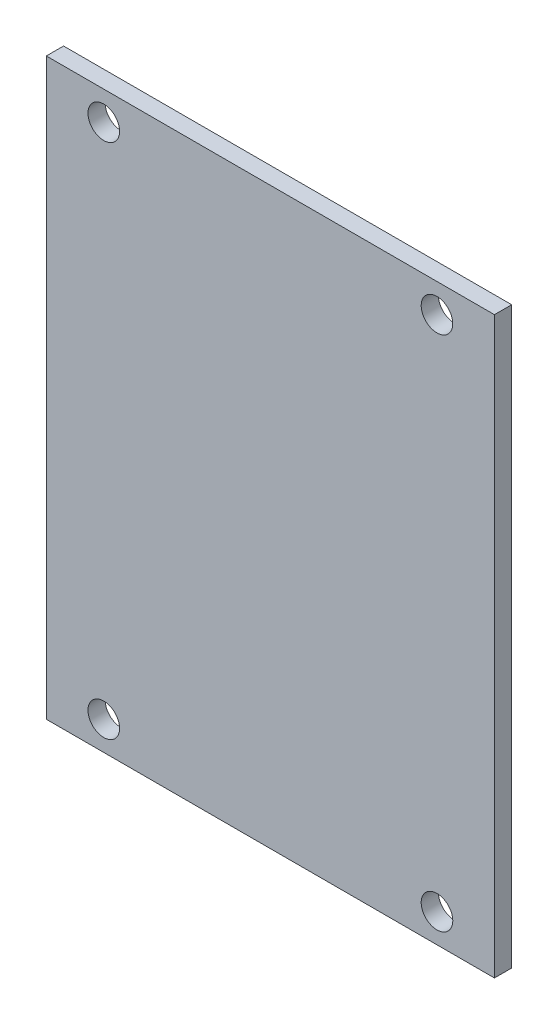
ISO-10303-21;
HEADER;
FILE_DESCRIPTION(('STEP AP214'),'2;1');
FILE_NAME('part.step','',(''),(''),'','','');
FILE_SCHEMA(('AUTOMOTIVE_DESIGN { 1 0 10303 214 1 1 1 1 }'));
ENDSEC;
DATA;
#1=APPLICATION_CONTEXT('core data for automotive mechanical design processes');
#2=APPLICATION_PROTOCOL_DEFINITION('international standard','automotive_design',2000,#1);
#3=PRODUCT_CONTEXT('',#1,'mechanical');
#4=PRODUCT('Part','Part','',(#3));
#5=PRODUCT_RELATED_PRODUCT_CATEGORY('part','',(#4));
#6=PRODUCT_DEFINITION_FORMATION('','',#4);
#7=PRODUCT_DEFINITION_CONTEXT('part definition',#1,'design');
#8=PRODUCT_DEFINITION('design','',#6,#7);
#9=PRODUCT_DEFINITION_SHAPE('','',#8);
#10=(LENGTH_UNIT() NAMED_UNIT(*) SI_UNIT(.MILLI.,.METRE.));
#11=(NAMED_UNIT(*) PLANE_ANGLE_UNIT() SI_UNIT($,.RADIAN.));
#12=(NAMED_UNIT(*) SI_UNIT($,.STERADIAN.) SOLID_ANGLE_UNIT());
#13=UNCERTAINTY_MEASURE_WITH_UNIT(LENGTH_MEASURE(1.E-05),#10,'distance_accuracy_value','');
#14=(GEOMETRIC_REPRESENTATION_CONTEXT(3) GLOBAL_UNCERTAINTY_ASSIGNED_CONTEXT((#13)) GLOBAL_UNIT_ASSIGNED_CONTEXT((#10,
#11,#12)) REPRESENTATION_CONTEXT('',''));
#15=CARTESIAN_POINT('',(0.,0.,0.));
#16=DIRECTION('',(0.,0.,1.));
#17=DIRECTION('',(1.,0.,0.));
#18=AXIS2_PLACEMENT_3D('',#15,#16,#17);
#19=CARTESIAN_POINT('',(0.,0.,3.));
#20=DIRECTION('',(1.,0.,0.));
#21=DIRECTION('',(0.,1.,0.));
#22=AXIS2_PLACEMENT_3D('',#19,#20,#21);
#23=PLANE('',#22);
#24=DIRECTION('',(0.,-1.,0.));
#25=VECTOR('',#24,1.);
#26=CARTESIAN_POINT('',(0.,0.,0.));
#27=LINE('',#26,#25);
#28=CARTESIAN_POINT('',(0.,100.,0.));
#29=VERTEX_POINT('',#28);
#30=CARTESIAN_POINT('',(0.,0.,0.));
#31=VERTEX_POINT('',#30);
#32=EDGE_CURVE('E101',#29,#31,#27,.T.);
#33=ORIENTED_EDGE('',*,*,#32,.T.);
#34=DIRECTION('',(0.,0.,-1.));
#35=VECTOR('',#34,1.);
#36=CARTESIAN_POINT('',(0.,0.,3.));
#37=LINE('',#36,#35);
#38=CARTESIAN_POINT('',(0.,0.,3.));
#39=VERTEX_POINT('',#38);
#40=EDGE_CURVE('E11',#39,#31,#37,.T.);
#41=ORIENTED_EDGE('',*,*,#40,.F.);
#42=DIRECTION('',(0.,-1.,0.));
#43=VECTOR('',#42,1.);
#44=CARTESIAN_POINT('',(0.,0.,3.));
#45=LINE('',#44,#43);
#46=CARTESIAN_POINT('',(0.,100.,3.));
#47=VERTEX_POINT('',#46);
#48=EDGE_CURVE('E88',#47,#39,#45,.T.);
#49=ORIENTED_EDGE('',*,*,#48,.F.);
#50=DIRECTION('',(0.,0.,-1.));
#51=VECTOR('',#50,1.);
#52=CARTESIAN_POINT('',(0.,100.,3.));
#53=LINE('',#52,#51);
#54=EDGE_CURVE('E97',#47,#29,#53,.T.);
#55=ORIENTED_EDGE('',*,*,#54,.T.);
#56=EDGE_LOOP('',(#33,#41,#49,#55));
#57=FACE_BOUND('',#56,.T.);
#58=ADVANCED_FACE('F35',(#57),#23,.F.);
#59=CARTESIAN_POINT('',(0.,0.,3.));
#60=DIRECTION('',(0.,1.,0.));
#61=DIRECTION('',(0.,0.,1.));
#62=AXIS2_PLACEMENT_3D('',#59,#60,#61);
#63=PLANE('',#62);
#64=DIRECTION('',(1.,0.,0.));
#65=VECTOR('',#64,1.);
#66=CARTESIAN_POINT('',(0.,0.,0.));
#67=LINE('',#66,#65);
#68=CARTESIAN_POINT('',(78.,0.,0.));
#69=VERTEX_POINT('',#68);
#70=EDGE_CURVE('E92',#31,#69,#67,.T.);
#71=ORIENTED_EDGE('',*,*,#70,.T.);
#72=DIRECTION('',(0.,0.,-1.));
#73=VECTOR('',#72,1.);
#74=CARTESIAN_POINT('',(78.,0.,3.));
#75=LINE('',#74,#73);
#76=CARTESIAN_POINT('',(78.,0.,3.));
#77=VERTEX_POINT('',#76);
#78=EDGE_CURVE('E44',#77,#69,#75,.T.);
#79=ORIENTED_EDGE('',*,*,#78,.F.);
#80=DIRECTION('',(1.,0.,0.));
#81=VECTOR('',#80,1.);
#82=CARTESIAN_POINT('',(0.,0.,3.));
#83=LINE('',#82,#81);
#84=EDGE_CURVE('E83',#39,#77,#83,.T.);
#85=ORIENTED_EDGE('',*,*,#84,.F.);
#86=ORIENTED_EDGE('',*,*,#40,.T.);
#87=EDGE_LOOP('',(#71,#79,#85,#86));
#88=FACE_BOUND('',#87,.T.);
#89=ADVANCED_FACE('F91',(#88),#63,.F.);
#90=CARTESIAN_POINT('',(78.,0.,3.));
#91=DIRECTION('',(-1.,0.,0.));
#92=DIRECTION('',(0.,-1.,0.));
#93=AXIS2_PLACEMENT_3D('',#90,#91,#92);
#94=PLANE('',#93);
#95=DIRECTION('',(0.,1.,0.));
#96=VECTOR('',#95,1.);
#97=CARTESIAN_POINT('',(78.,0.,0.));
#98=LINE('',#97,#96);
#99=CARTESIAN_POINT('',(78.,100.,0.));
#100=VERTEX_POINT('',#99);
#101=EDGE_CURVE('E70',#69,#100,#98,.T.);
#102=ORIENTED_EDGE('',*,*,#101,.T.);
#103=DIRECTION('',(0.,0.,-1.));
#104=VECTOR('',#103,1.);
#105=CARTESIAN_POINT('',(78.,100.,3.));
#106=LINE('',#105,#104);
#107=CARTESIAN_POINT('',(78.,100.,3.));
#108=VERTEX_POINT('',#107);
#109=EDGE_CURVE('E93',#108,#100,#106,.T.);
#110=ORIENTED_EDGE('',*,*,#109,.F.);
#111=DIRECTION('',(0.,1.,0.));
#112=VECTOR('',#111,1.);
#113=CARTESIAN_POINT('',(78.,0.,3.));
#114=LINE('',#113,#112);
#115=EDGE_CURVE('E86',#77,#108,#114,.T.);
#116=ORIENTED_EDGE('',*,*,#115,.F.);
#117=ORIENTED_EDGE('',*,*,#78,.T.);
#118=EDGE_LOOP('',(#102,#110,#116,#117));
#119=FACE_BOUND('',#118,.T.);
#120=ADVANCED_FACE('F95',(#119),#94,.F.);
#121=CARTESIAN_POINT('',(0.,100.,3.));
#122=DIRECTION('',(0.,-1.,0.));
#123=DIRECTION('',(0.,0.,-1.));
#124=AXIS2_PLACEMENT_3D('',#121,#122,#123);
#125=PLANE('',#124);
#126=DIRECTION('',(-1.,0.,0.));
#127=VECTOR('',#126,1.);
#128=CARTESIAN_POINT('',(0.,100.,0.));
#129=LINE('',#128,#127);
#130=EDGE_CURVE('E76',#100,#29,#129,.T.);
#131=ORIENTED_EDGE('',*,*,#130,.T.);
#132=ORIENTED_EDGE('',*,*,#54,.F.);
#133=DIRECTION('',(-1.,0.,0.));
#134=VECTOR('',#133,1.);
#135=CARTESIAN_POINT('',(0.,100.,3.));
#136=LINE('',#135,#134);
#137=EDGE_CURVE('E53',#108,#47,#136,.T.);
#138=ORIENTED_EDGE('',*,*,#137,.F.);
#139=ORIENTED_EDGE('',*,*,#109,.T.);
#140=EDGE_LOOP('',(#131,#132,#138,#139));
#141=FACE_BOUND('',#140,.T.);
#142=ADVANCED_FACE('F142',(#141),#125,.F.);
#143=CARTESIAN_POINT('',(0.,0.,3.));
#144=DIRECTION('',(0.,0.,-1.));
#145=DIRECTION('',(-1.,0.,0.));
#146=AXIS2_PLACEMENT_3D('',#143,#144,#145);
#147=PLANE('',#146);
#148=CARTESIAN_POINT('',(10.,4.99999999999999,3.));
#149=DIRECTION('',(0.,0.,1.));
#150=DIRECTION('',(-1.,0.,0.));
#151=AXIS2_PLACEMENT_3D('',#148,#149,#150);
#152=CIRCLE('',#151,2.75);
#153=CARTESIAN_POINT('',(7.25,4.99999999999999,3.));
#154=VERTEX_POINT('',#153);
#155=EDGE_CURVE('E116',#154,#154,#152,.T.);
#156=ORIENTED_EDGE('',*,*,#155,.F.);
#157=EDGE_LOOP('',(#156));
#158=FACE_BOUND('',#157,.T.);
#159=CARTESIAN_POINT('',(68.,5.,3.));
#160=DIRECTION('',(0.,0.,1.));
#161=DIRECTION('',(1.,0.,0.));
#162=AXIS2_PLACEMENT_3D('',#159,#160,#161);
#163=CIRCLE('',#162,2.75000000000001);
#164=CARTESIAN_POINT('',(70.75,5.,3.));
#165=VERTEX_POINT('',#164);
#166=EDGE_CURVE('E131',#165,#165,#163,.T.);
#167=ORIENTED_EDGE('',*,*,#166,.F.);
#168=EDGE_LOOP('',(#167));
#169=FACE_BOUND('',#168,.T.);
#170=CARTESIAN_POINT('',(68.,95.,3.));
#171=DIRECTION('',(0.,0.,1.));
#172=DIRECTION('',(-1.,0.,0.));
#173=AXIS2_PLACEMENT_3D('',#170,#171,#172);
#174=CIRCLE('',#173,2.75);
#175=CARTESIAN_POINT('',(65.25,95.,3.));
#176=VERTEX_POINT('',#175);
#177=EDGE_CURVE('E128',#176,#176,#174,.T.);
#178=ORIENTED_EDGE('',*,*,#177,.F.);
#179=EDGE_LOOP('',(#178));
#180=FACE_BOUND('',#179,.T.);
#181=CARTESIAN_POINT('',(9.99999999999998,95.,3.));
#182=DIRECTION('',(0.,0.,1.));
#183=DIRECTION('',(1.,0.,0.));
#184=AXIS2_PLACEMENT_3D('',#181,#182,#183);
#185=CIRCLE('',#184,2.75);
#186=CARTESIAN_POINT('',(12.75,95.,3.));
#187=VERTEX_POINT('',#186);
#188=EDGE_CURVE('E112',#187,#187,#185,.T.);
#189=ORIENTED_EDGE('',*,*,#188,.F.);
#190=EDGE_LOOP('',(#189));
#191=FACE_BOUND('',#190,.T.);
#192=ORIENTED_EDGE('',*,*,#48,.T.);
#193=ORIENTED_EDGE('',*,*,#84,.T.);
#194=ORIENTED_EDGE('',*,*,#115,.T.);
#195=ORIENTED_EDGE('',*,*,#137,.T.);
#196=EDGE_LOOP('',(#192,#193,#194,#195));
#197=FACE_BOUND('',#196,.T.);
#198=ADVANCED_FACE('F84',(#158,#169,#180,#191,#197),#147,.F.);
#199=CARTESIAN_POINT('',(0.,0.,0.));
#200=DIRECTION('',(0.,0.,-1.));
#201=DIRECTION('',(-1.,0.,0.));
#202=AXIS2_PLACEMENT_3D('',#199,#200,#201);
#203=PLANE('',#202);
#204=CARTESIAN_POINT('',(10.,4.99999999999999,0.));
#205=DIRECTION('',(0.,0.,-1.));
#206=DIRECTION('',(-1.,0.,0.));
#207=AXIS2_PLACEMENT_3D('',#204,#205,#206);
#208=CIRCLE('',#207,2.75);
#209=CARTESIAN_POINT('',(7.25,4.99999999999999,0.));
#210=VERTEX_POINT('',#209);
#211=EDGE_CURVE('E38',#210,#210,#208,.T.);
#212=ORIENTED_EDGE('',*,*,#211,.F.);
#213=EDGE_LOOP('',(#212));
#214=FACE_BOUND('',#213,.T.);
#215=CARTESIAN_POINT('',(68.,5.,0.));
#216=DIRECTION('',(0.,0.,-1.));
#217=DIRECTION('',(-1.,0.,0.));
#218=AXIS2_PLACEMENT_3D('',#215,#216,#217);
#219=CIRCLE('',#218,2.75000000000001);
#220=CARTESIAN_POINT('',(65.25,5.,0.));
#221=VERTEX_POINT('',#220);
#222=EDGE_CURVE('E115',#221,#221,#219,.T.);
#223=ORIENTED_EDGE('',*,*,#222,.F.);
#224=EDGE_LOOP('',(#223));
#225=FACE_BOUND('',#224,.T.);
#226=CARTESIAN_POINT('',(68.,95.,0.));
#227=DIRECTION('',(0.,0.,-1.));
#228=DIRECTION('',(-1.,0.,0.));
#229=AXIS2_PLACEMENT_3D('',#226,#227,#228);
#230=CIRCLE('',#229,2.75);
#231=CARTESIAN_POINT('',(65.25,95.,0.));
#232=VERTEX_POINT('',#231);
#233=EDGE_CURVE('E113',#232,#232,#230,.T.);
#234=ORIENTED_EDGE('',*,*,#233,.F.);
#235=EDGE_LOOP('',(#234));
#236=FACE_BOUND('',#235,.T.);
#237=CARTESIAN_POINT('',(9.99999999999998,95.,0.));
#238=DIRECTION('',(0.,0.,-1.));
#239=DIRECTION('',(-1.,0.,0.));
#240=AXIS2_PLACEMENT_3D('',#237,#238,#239);
#241=CIRCLE('',#240,2.75);
#242=CARTESIAN_POINT('',(7.24999999999998,95.,0.));
#243=VERTEX_POINT('',#242);
#244=EDGE_CURVE('E104',#243,#243,#241,.T.);
#245=ORIENTED_EDGE('',*,*,#244,.F.);
#246=EDGE_LOOP('',(#245));
#247=FACE_BOUND('',#246,.T.);
#248=ORIENTED_EDGE('',*,*,#32,.F.);
#249=ORIENTED_EDGE('',*,*,#130,.F.);
#250=ORIENTED_EDGE('',*,*,#101,.F.);
#251=ORIENTED_EDGE('',*,*,#70,.F.);
#252=EDGE_LOOP('',(#248,#249,#250,#251));
#253=FACE_BOUND('',#252,.T.);
#254=ADVANCED_FACE('F141',(#214,#225,#236,#247,#253),#203,.T.);
#255=CARTESIAN_POINT('',(9.99999999999998,95.,-7.));
#256=DIRECTION('',(0.,0.,1.));
#257=DIRECTION('',(1.,0.,0.));
#258=AXIS2_PLACEMENT_3D('',#255,#256,#257);
#259=CYLINDRICAL_SURFACE('',#258,2.75);
#260=ORIENTED_EDGE('',*,*,#244,.T.);
#261=EDGE_LOOP('',(#260));
#262=FACE_BOUND('',#261,.T.);
#263=ORIENTED_EDGE('',*,*,#188,.T.);
#264=EDGE_LOOP('',(#263));
#265=FACE_BOUND('',#264,.T.);
#266=ADVANCED_FACE('F152',(#262,#265),#259,.F.);
#267=CARTESIAN_POINT('',(68.,95.,-7.));
#268=DIRECTION('',(0.,0.,1.));
#269=DIRECTION('',(1.,0.,0.));
#270=AXIS2_PLACEMENT_3D('',#267,#268,#269);
#271=CYLINDRICAL_SURFACE('',#270,2.75);
#272=ORIENTED_EDGE('',*,*,#233,.T.);
#273=EDGE_LOOP('',(#272));
#274=FACE_BOUND('',#273,.T.);
#275=ORIENTED_EDGE('',*,*,#177,.T.);
#276=EDGE_LOOP('',(#275));
#277=FACE_BOUND('',#276,.T.);
#278=ADVANCED_FACE('F149',(#274,#277),#271,.F.);
#279=CARTESIAN_POINT('',(68.,5.,-7.));
#280=DIRECTION('',(0.,0.,1.));
#281=DIRECTION('',(1.,0.,0.));
#282=AXIS2_PLACEMENT_3D('',#279,#280,#281);
#283=CYLINDRICAL_SURFACE('',#282,2.75000000000001);
#284=ORIENTED_EDGE('',*,*,#222,.T.);
#285=EDGE_LOOP('',(#284));
#286=FACE_BOUND('',#285,.T.);
#287=ORIENTED_EDGE('',*,*,#166,.T.);
#288=EDGE_LOOP('',(#287));
#289=FACE_BOUND('',#288,.T.);
#290=ADVANCED_FACE('F151',(#286,#289),#283,.F.);
#291=CARTESIAN_POINT('',(10.,4.99999999999999,-7.));
#292=DIRECTION('',(0.,0.,1.));
#293=DIRECTION('',(1.,0.,0.));
#294=AXIS2_PLACEMENT_3D('',#291,#292,#293);
#295=CYLINDRICAL_SURFACE('',#294,2.75);
#296=ORIENTED_EDGE('',*,*,#211,.T.);
#297=EDGE_LOOP('',(#296));
#298=FACE_BOUND('',#297,.T.);
#299=ORIENTED_EDGE('',*,*,#155,.T.);
#300=EDGE_LOOP('',(#299));
#301=FACE_BOUND('',#300,.T.);
#302=ADVANCED_FACE('F137',(#298,#301),#295,.F.);
#303=CLOSED_SHELL('',(#58,#89,#120,#142,#198,#254,#266,#278,#290,#302));
#304=MANIFOLD_SOLID_BREP('B2',#303);
#305=ADVANCED_BREP_SHAPE_REPRESENTATION('',(#18,#304),#14);
#306=SHAPE_DEFINITION_REPRESENTATION(#9,#305);
ENDSEC;
END-ISO-10303-21;
